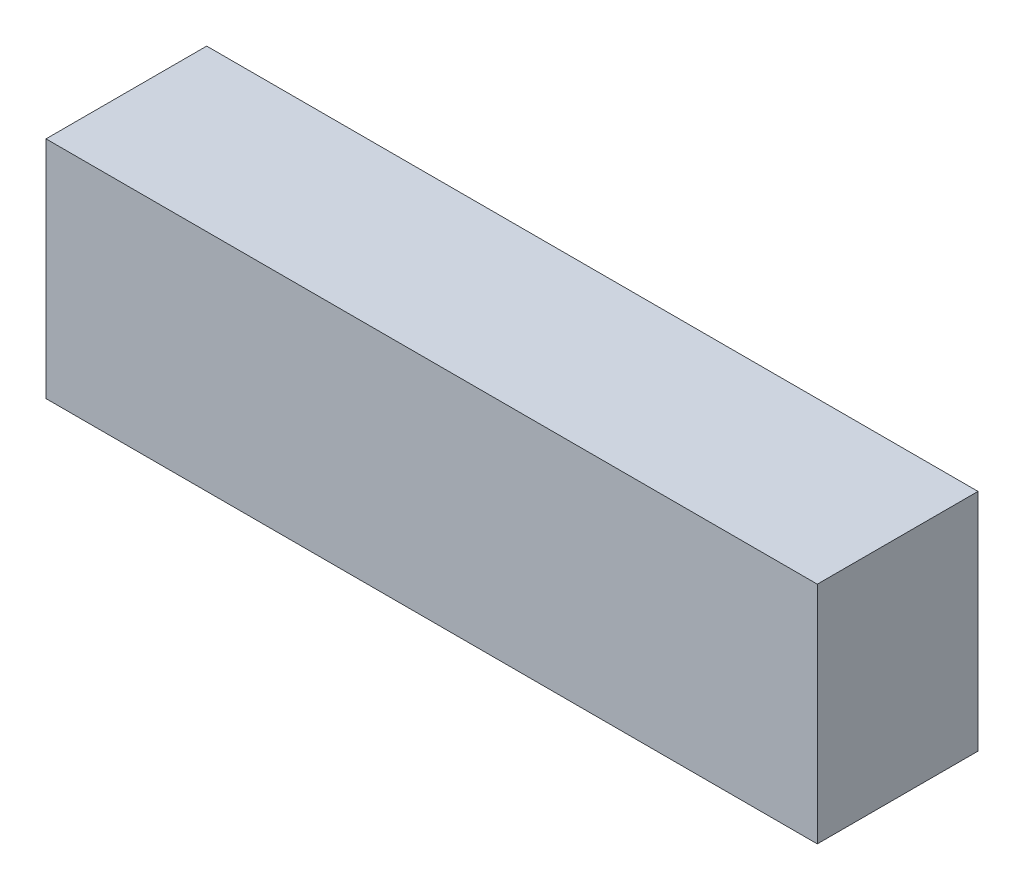
ISO-10303-21;
HEADER;
FILE_DESCRIPTION(('STEP AP214'),'2;1');
FILE_NAME('part.step','',(''),(''),'','','');
FILE_SCHEMA(('AUTOMOTIVE_DESIGN { 1 0 10303 214 1 1 1 1 }'));
ENDSEC;
DATA;
#1=APPLICATION_CONTEXT('core data for automotive mechanical design processes');
#2=APPLICATION_PROTOCOL_DEFINITION('international standard','automotive_design',2000,#1);
#3=PRODUCT_CONTEXT('',#1,'mechanical');
#4=PRODUCT('Part','Part','',(#3));
#5=PRODUCT_RELATED_PRODUCT_CATEGORY('part','',(#4));
#6=PRODUCT_DEFINITION_FORMATION('','',#4);
#7=PRODUCT_DEFINITION_CONTEXT('part definition',#1,'design');
#8=PRODUCT_DEFINITION('design','',#6,#7);
#9=PRODUCT_DEFINITION_SHAPE('','',#8);
#10=(LENGTH_UNIT() NAMED_UNIT(*) SI_UNIT(.MILLI.,.METRE.));
#11=(NAMED_UNIT(*) PLANE_ANGLE_UNIT() SI_UNIT($,.RADIAN.));
#12=(NAMED_UNIT(*) SI_UNIT($,.STERADIAN.) SOLID_ANGLE_UNIT());
#13=UNCERTAINTY_MEASURE_WITH_UNIT(LENGTH_MEASURE(1.E-05),#10,'distance_accuracy_value','');
#14=(GEOMETRIC_REPRESENTATION_CONTEXT(3) GLOBAL_UNCERTAINTY_ASSIGNED_CONTEXT((#13)) GLOBAL_UNIT_ASSIGNED_CONTEXT((#10,
#11,#12)) REPRESENTATION_CONTEXT('',''));
#15=CARTESIAN_POINT('',(0.,0.,0.));
#16=DIRECTION('',(0.,0.,1.));
#17=DIRECTION('',(1.,0.,0.));
#18=AXIS2_PLACEMENT_3D('',#15,#16,#17);
#19=CARTESIAN_POINT('',(0.,0.,25.));
#20=DIRECTION('',(1.,0.,0.));
#21=DIRECTION('',(0.,0.,-1.));
#22=AXIS2_PLACEMENT_3D('',#19,#20,#21);
#23=PLANE('',#22);
#24=DIRECTION('',(0.,-1.,0.));
#25=VECTOR('',#24,1.);
#26=CARTESIAN_POINT('',(0.,0.,0.));
#27=LINE('',#26,#25);
#28=CARTESIAN_POINT('',(0.,35.,0.));
#29=VERTEX_POINT('',#28);
#30=CARTESIAN_POINT('',(0.,0.,0.));
#31=VERTEX_POINT('',#30);
#32=EDGE_CURVE('E95',#29,#31,#27,.T.);
#33=ORIENTED_EDGE('',*,*,#32,.T.);
#34=DIRECTION('',(0.,0.,-1.));
#35=VECTOR('',#34,1.);
#36=CARTESIAN_POINT('',(0.,0.,25.));
#37=LINE('',#36,#35);
#38=CARTESIAN_POINT('',(0.,0.,25.));
#39=VERTEX_POINT('',#38);
#40=EDGE_CURVE('E11',#39,#31,#37,.T.);
#41=ORIENTED_EDGE('',*,*,#40,.F.);
#42=DIRECTION('',(0.,-1.,0.));
#43=VECTOR('',#42,1.);
#44=CARTESIAN_POINT('',(0.,0.,25.));
#45=LINE('',#44,#43);
#46=CARTESIAN_POINT('',(0.,35.,25.));
#47=VERTEX_POINT('',#46);
#48=EDGE_CURVE('E83',#47,#39,#45,.T.);
#49=ORIENTED_EDGE('',*,*,#48,.F.);
#50=DIRECTION('',(0.,0.,-1.));
#51=VECTOR('',#50,1.);
#52=CARTESIAN_POINT('',(0.,35.,25.));
#53=LINE('',#52,#51);
#54=EDGE_CURVE('E91',#47,#29,#53,.T.);
#55=ORIENTED_EDGE('',*,*,#54,.T.);
#56=EDGE_LOOP('',(#33,#41,#49,#55));
#57=FACE_BOUND('',#56,.T.);
#58=ADVANCED_FACE('F32',(#57),#23,.F.);
#59=CARTESIAN_POINT('',(0.,0.,25.));
#60=DIRECTION('',(0.,1.,0.));
#61=DIRECTION('',(0.,0.,1.));
#62=AXIS2_PLACEMENT_3D('',#59,#60,#61);
#63=PLANE('',#62);
#64=DIRECTION('',(1.,0.,0.));
#65=VECTOR('',#64,1.);
#66=CARTESIAN_POINT('',(0.,0.,0.));
#67=LINE('',#66,#65);
#68=CARTESIAN_POINT('',(120.,0.,0.));
#69=VERTEX_POINT('',#68);
#70=EDGE_CURVE('E87',#31,#69,#67,.T.);
#71=ORIENTED_EDGE('',*,*,#70,.T.);
#72=DIRECTION('',(0.,0.,-1.));
#73=VECTOR('',#72,1.);
#74=CARTESIAN_POINT('',(120.,0.,25.));
#75=LINE('',#74,#73);
#76=CARTESIAN_POINT('',(120.,0.,25.));
#77=VERTEX_POINT('',#76);
#78=EDGE_CURVE('E40',#77,#69,#75,.T.);
#79=ORIENTED_EDGE('',*,*,#78,.F.);
#80=DIRECTION('',(1.,0.,0.));
#81=VECTOR('',#80,1.);
#82=CARTESIAN_POINT('',(0.,0.,25.));
#83=LINE('',#82,#81);
#84=EDGE_CURVE('E78',#39,#77,#83,.T.);
#85=ORIENTED_EDGE('',*,*,#84,.F.);
#86=ORIENTED_EDGE('',*,*,#40,.T.);
#87=EDGE_LOOP('',(#71,#79,#85,#86));
#88=FACE_BOUND('',#87,.T.);
#89=ADVANCED_FACE('F86',(#88),#63,.F.);
#90=CARTESIAN_POINT('',(120.,0.,25.));
#91=DIRECTION('',(-1.,0.,0.));
#92=DIRECTION('',(0.,0.,1.));
#93=AXIS2_PLACEMENT_3D('',#90,#91,#92);
#94=PLANE('',#93);
#95=DIRECTION('',(0.,1.,0.));
#96=VECTOR('',#95,1.);
#97=CARTESIAN_POINT('',(120.,0.,0.));
#98=LINE('',#97,#96);
#99=CARTESIAN_POINT('',(120.,35.,0.));
#100=VERTEX_POINT('',#99);
#101=EDGE_CURVE('E65',#69,#100,#98,.T.);
#102=ORIENTED_EDGE('',*,*,#101,.T.);
#103=DIRECTION('',(0.,0.,-1.));
#104=VECTOR('',#103,1.);
#105=CARTESIAN_POINT('',(120.,35.,25.));
#106=LINE('',#105,#104);
#107=CARTESIAN_POINT('',(120.,35.,25.));
#108=VERTEX_POINT('',#107);
#109=EDGE_CURVE('E88',#108,#100,#106,.T.);
#110=ORIENTED_EDGE('',*,*,#109,.F.);
#111=DIRECTION('',(0.,1.,0.));
#112=VECTOR('',#111,1.);
#113=CARTESIAN_POINT('',(120.,0.,25.));
#114=LINE('',#113,#112);
#115=EDGE_CURVE('E81',#77,#108,#114,.T.);
#116=ORIENTED_EDGE('',*,*,#115,.F.);
#117=ORIENTED_EDGE('',*,*,#78,.T.);
#118=EDGE_LOOP('',(#102,#110,#116,#117));
#119=FACE_BOUND('',#118,.T.);
#120=ADVANCED_FACE('F89',(#119),#94,.F.);
#121=CARTESIAN_POINT('',(0.,35.,25.));
#122=DIRECTION('',(0.,-1.,0.));
#123=DIRECTION('',(0.,0.,-1.));
#124=AXIS2_PLACEMENT_3D('',#121,#122,#123);
#125=PLANE('',#124);
#126=DIRECTION('',(-1.,0.,0.));
#127=VECTOR('',#126,1.);
#128=CARTESIAN_POINT('',(0.,35.,0.));
#129=LINE('',#128,#127);
#130=EDGE_CURVE('E71',#100,#29,#129,.T.);
#131=ORIENTED_EDGE('',*,*,#130,.T.);
#132=ORIENTED_EDGE('',*,*,#54,.F.);
#133=DIRECTION('',(-1.,0.,0.));
#134=VECTOR('',#133,1.);
#135=CARTESIAN_POINT('',(0.,35.,25.));
#136=LINE('',#135,#134);
#137=EDGE_CURVE('E48',#108,#47,#136,.T.);
#138=ORIENTED_EDGE('',*,*,#137,.F.);
#139=ORIENTED_EDGE('',*,*,#109,.T.);
#140=EDGE_LOOP('',(#131,#132,#138,#139));
#141=FACE_BOUND('',#140,.T.);
#142=ADVANCED_FACE('F102',(#141),#125,.F.);
#143=CARTESIAN_POINT('',(0.,35.,25.));
#144=DIRECTION('',(0.,0.,-1.));
#145=DIRECTION('',(-1.,0.,0.));
#146=AXIS2_PLACEMENT_3D('',#143,#144,#145);
#147=PLANE('',#146);
#148=ORIENTED_EDGE('',*,*,#48,.T.);
#149=ORIENTED_EDGE('',*,*,#84,.T.);
#150=ORIENTED_EDGE('',*,*,#115,.T.);
#151=ORIENTED_EDGE('',*,*,#137,.T.);
#152=EDGE_LOOP('',(#148,#149,#150,#151));
#153=FACE_BOUND('',#152,.T.);
#154=ADVANCED_FACE('F79',(#153),#147,.F.);
#155=CARTESIAN_POINT('',(0.,35.,0.));
#156=DIRECTION('',(0.,0.,-1.));
#157=DIRECTION('',(-1.,0.,0.));
#158=AXIS2_PLACEMENT_3D('',#155,#156,#157);
#159=PLANE('',#158);
#160=ORIENTED_EDGE('',*,*,#32,.F.);
#161=ORIENTED_EDGE('',*,*,#130,.F.);
#162=ORIENTED_EDGE('',*,*,#101,.F.);
#163=ORIENTED_EDGE('',*,*,#70,.F.);
#164=EDGE_LOOP('',(#160,#161,#162,#163));
#165=FACE_BOUND('',#164,.T.);
#166=ADVANCED_FACE('F105',(#165),#159,.T.);
#167=CLOSED_SHELL('',(#58,#89,#120,#142,#154,#166));
#168=MANIFOLD_SOLID_BREP('B2',#167);
#169=ADVANCED_BREP_SHAPE_REPRESENTATION('',(#18,#168),#14);
#170=SHAPE_DEFINITION_REPRESENTATION(#9,#169);
ENDSEC;
END-ISO-10303-21;
